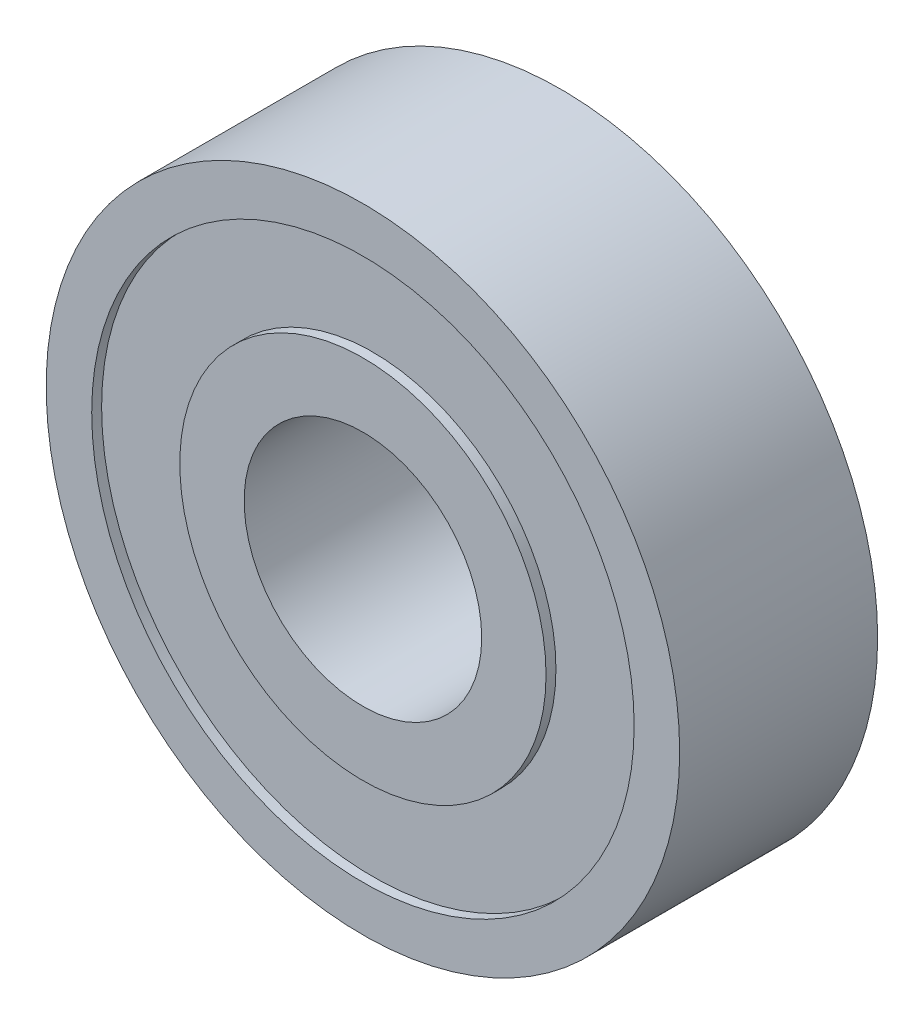
ISO-10303-21;
HEADER;
FILE_DESCRIPTION(('STEP AP214'),'2;1');
FILE_NAME('part.step','',(''),(''),'','','');
FILE_SCHEMA(('AUTOMOTIVE_DESIGN { 1 0 10303 214 1 1 1 1 }'));
ENDSEC;
DATA;
#1=APPLICATION_CONTEXT('core data for automotive mechanical design processes');
#2=APPLICATION_PROTOCOL_DEFINITION('international standard','automotive_design',2000,#1);
#3=PRODUCT_CONTEXT('',#1,'mechanical');
#4=PRODUCT('Part','Part','',(#3));
#5=PRODUCT_RELATED_PRODUCT_CATEGORY('part','',(#4));
#6=PRODUCT_DEFINITION_FORMATION('','',#4);
#7=PRODUCT_DEFINITION_CONTEXT('part definition',#1,'design');
#8=PRODUCT_DEFINITION('design','',#6,#7);
#9=PRODUCT_DEFINITION_SHAPE('','',#8);
#10=(LENGTH_UNIT() NAMED_UNIT(*) SI_UNIT(.MILLI.,.METRE.));
#11=(NAMED_UNIT(*) PLANE_ANGLE_UNIT() SI_UNIT($,.RADIAN.));
#12=(NAMED_UNIT(*) SI_UNIT($,.STERADIAN.) SOLID_ANGLE_UNIT());
#13=UNCERTAINTY_MEASURE_WITH_UNIT(LENGTH_MEASURE(1.E-05),#10,'distance_accuracy_value','');
#14=(GEOMETRIC_REPRESENTATION_CONTEXT(3) GLOBAL_UNCERTAINTY_ASSIGNED_CONTEXT((#13)) GLOBAL_UNIT_ASSIGNED_CONTEXT((#10,
#11,#12)) REPRESENTATION_CONTEXT('',''));
#15=CARTESIAN_POINT('',(0.,0.,0.));
#16=DIRECTION('',(0.,0.,1.));
#17=DIRECTION('',(1.,0.,0.));
#18=AXIS2_PLACEMENT_3D('',#15,#16,#17);
#19=CARTESIAN_POINT('',(0.,0.,-5.));
#20=DIRECTION('',(0.,0.,1.));
#21=DIRECTION('',(1.,0.,0.));
#22=AXIS2_PLACEMENT_3D('',#19,#20,#21);
#23=PLANE('',#22);
#24=CARTESIAN_POINT('',(0.,0.,-5.));
#25=DIRECTION('',(0.,0.,1.));
#26=DIRECTION('',(1.,0.,0.));
#27=AXIS2_PLACEMENT_3D('',#24,#25,#26);
#28=CIRCLE('',#27,6.);
#29=CARTESIAN_POINT('',(6.,0.,-5.));
#30=VERTEX_POINT('',#29);
#31=EDGE_CURVE('E42',#30,#30,#28,.T.);
#32=ORIENTED_EDGE('',*,*,#31,.T.);
#33=EDGE_LOOP('',(#32));
#34=FACE_BOUND('',#33,.T.);
#35=CARTESIAN_POINT('',(0.,0.,-5.));
#36=DIRECTION('',(0.,0.,1.));
#37=DIRECTION('',(1.,0.,0.));
#38=AXIS2_PLACEMENT_3D('',#35,#36,#37);
#39=CIRCLE('',#38,9.25);
#40=CARTESIAN_POINT('',(9.25,0.,-5.));
#41=VERTEX_POINT('',#40);
#42=EDGE_CURVE('E68',#41,#41,#39,.T.);
#43=ORIENTED_EDGE('',*,*,#42,.F.);
#44=EDGE_LOOP('',(#43));
#45=FACE_BOUND('',#44,.T.);
#46=ADVANCED_FACE('F31',(#34,#45),#23,.F.);
#47=CARTESIAN_POINT('',(0.,0.,5.));
#48=DIRECTION('',(0.,0.,1.));
#49=DIRECTION('',(1.,0.,0.));
#50=AXIS2_PLACEMENT_3D('',#47,#48,#49);
#51=PLANE('',#50);
#52=CARTESIAN_POINT('',(0.,0.,5.));
#53=DIRECTION('',(0.,0.,1.));
#54=DIRECTION('',(1.,0.,0.));
#55=AXIS2_PLACEMENT_3D('',#52,#53,#54);
#56=CIRCLE('',#55,6.);
#57=CARTESIAN_POINT('',(6.,0.,5.));
#58=VERTEX_POINT('',#57);
#59=EDGE_CURVE('E44',#58,#58,#56,.T.);
#60=ORIENTED_EDGE('',*,*,#59,.F.);
#61=EDGE_LOOP('',(#60));
#62=FACE_BOUND('',#61,.T.);
#63=CARTESIAN_POINT('',(0.,0.,5.));
#64=DIRECTION('',(0.,0.,1.));
#65=DIRECTION('',(1.,0.,0.));
#66=AXIS2_PLACEMENT_3D('',#63,#64,#65);
#67=CIRCLE('',#66,9.25);
#68=CARTESIAN_POINT('',(9.25,0.,5.));
#69=VERTEX_POINT('',#68);
#70=EDGE_CURVE('E56',#69,#69,#67,.T.);
#71=ORIENTED_EDGE('',*,*,#70,.T.);
#72=EDGE_LOOP('',(#71));
#73=FACE_BOUND('',#72,.T.);
#74=ADVANCED_FACE('F84',(#62,#73),#51,.T.);
#75=CARTESIAN_POINT('',(0.,0.,5.));
#76=DIRECTION('',(0.,0.,-1.));
#77=DIRECTION('',(-1.,0.,0.));
#78=AXIS2_PLACEMENT_3D('',#75,#76,#77);
#79=CYLINDRICAL_SURFACE('',#78,16.);
#80=CARTESIAN_POINT('',(0.,0.,5.));
#81=DIRECTION('',(0.,0.,1.));
#82=DIRECTION('',(1.,0.,0.));
#83=AXIS2_PLACEMENT_3D('',#80,#81,#82);
#84=CIRCLE('',#83,16.);
#85=CARTESIAN_POINT('',(16.,0.,5.));
#86=VERTEX_POINT('',#85);
#87=EDGE_CURVE('E10',#86,#86,#84,.T.);
#88=ORIENTED_EDGE('',*,*,#87,.F.);
#89=EDGE_LOOP('',(#88));
#90=FACE_BOUND('',#89,.T.);
#91=CARTESIAN_POINT('',(0.,0.,-5.));
#92=DIRECTION('',(0.,0.,1.));
#93=DIRECTION('',(1.,0.,0.));
#94=AXIS2_PLACEMENT_3D('',#91,#92,#93);
#95=CIRCLE('',#94,16.);
#96=CARTESIAN_POINT('',(16.,0.,-5.));
#97=VERTEX_POINT('',#96);
#98=EDGE_CURVE('E35',#97,#97,#95,.T.);
#99=ORIENTED_EDGE('',*,*,#98,.T.);
#100=EDGE_LOOP('',(#99));
#101=FACE_BOUND('',#100,.T.);
#102=ADVANCED_FACE('F33',(#90,#101),#79,.T.);
#103=CARTESIAN_POINT('',(0.,0.,5.));
#104=DIRECTION('',(0.,0.,1.));
#105=DIRECTION('',(1.,0.,0.));
#106=AXIS2_PLACEMENT_3D('',#103,#104,#105);
#107=CIRCLE('',#106,13.7);
#108=CARTESIAN_POINT('',(13.7,0.,5.));
#109=VERTEX_POINT('',#108);
#110=EDGE_CURVE('E50',#109,#109,#107,.T.);
#111=ORIENTED_EDGE('',*,*,#110,.F.);
#112=EDGE_LOOP('',(#111));
#113=FACE_BOUND('',#112,.T.);
#114=ORIENTED_EDGE('',*,*,#87,.T.);
#115=EDGE_LOOP('',(#114));
#116=FACE_BOUND('',#115,.T.);
#117=ADVANCED_FACE('F92',(#113,#116),#51,.T.);
#118=CARTESIAN_POINT('',(0.,0.,-5.));
#119=DIRECTION('',(0.,0.,1.));
#120=DIRECTION('',(1.,0.,0.));
#121=AXIS2_PLACEMENT_3D('',#118,#119,#120);
#122=CIRCLE('',#121,13.7);
#123=CARTESIAN_POINT('',(13.7,0.,-5.));
#124=VERTEX_POINT('',#123);
#125=EDGE_CURVE('E62',#124,#124,#122,.T.);
#126=ORIENTED_EDGE('',*,*,#125,.T.);
#127=EDGE_LOOP('',(#126));
#128=FACE_BOUND('',#127,.T.);
#129=ORIENTED_EDGE('',*,*,#98,.F.);
#130=EDGE_LOOP('',(#129));
#131=FACE_BOUND('',#130,.T.);
#132=ADVANCED_FACE('F86',(#128,#131),#23,.F.);
#133=CARTESIAN_POINT('',(0.,0.,-5.));
#134=DIRECTION('',(0.,0.,1.));
#135=DIRECTION('',(1.,0.,0.));
#136=AXIS2_PLACEMENT_3D('',#133,#134,#135);
#137=CYLINDRICAL_SURFACE('',#136,6.);
#138=ORIENTED_EDGE('',*,*,#31,.F.);
#139=EDGE_LOOP('',(#138));
#140=FACE_BOUND('',#139,.T.);
#141=ORIENTED_EDGE('',*,*,#59,.T.);
#142=EDGE_LOOP('',(#141));
#143=FACE_BOUND('',#142,.T.);
#144=ADVANCED_FACE('F94',(#140,#143),#137,.F.);
#145=CARTESIAN_POINT('',(0.,0.,4.5));
#146=DIRECTION('',(0.,0.,1.));
#147=DIRECTION('',(1.,0.,0.));
#148=AXIS2_PLACEMENT_3D('',#145,#146,#147);
#149=CYLINDRICAL_SURFACE('',#148,13.7);
#150=CARTESIAN_POINT('',(0.,0.,4.5));
#151=DIRECTION('',(0.,0.,1.));
#152=DIRECTION('',(1.,0.,0.));
#153=AXIS2_PLACEMENT_3D('',#150,#151,#152);
#154=CIRCLE('',#153,13.7);
#155=CARTESIAN_POINT('',(13.7,0.,4.5));
#156=VERTEX_POINT('',#155);
#157=EDGE_CURVE('E47',#156,#156,#154,.T.);
#158=ORIENTED_EDGE('',*,*,#157,.F.);
#159=EDGE_LOOP('',(#158));
#160=FACE_BOUND('',#159,.T.);
#161=ORIENTED_EDGE('',*,*,#110,.T.);
#162=EDGE_LOOP('',(#161));
#163=FACE_BOUND('',#162,.T.);
#164=ADVANCED_FACE('F100',(#160,#163),#149,.F.);
#165=CARTESIAN_POINT('',(0.,0.,4.5));
#166=DIRECTION('',(0.,0.,1.));
#167=DIRECTION('',(1.,0.,0.));
#168=AXIS2_PLACEMENT_3D('',#165,#166,#167);
#169=PLANE('',#168);
#170=CARTESIAN_POINT('',(0.,0.,4.5));
#171=DIRECTION('',(0.,0.,1.));
#172=DIRECTION('',(1.,0.,0.));
#173=AXIS2_PLACEMENT_3D('',#170,#171,#172);
#174=CIRCLE('',#173,9.25);
#175=CARTESIAN_POINT('',(9.25,0.,4.5));
#176=VERTEX_POINT('',#175);
#177=EDGE_CURVE('E53',#176,#176,#174,.T.);
#178=ORIENTED_EDGE('',*,*,#177,.F.);
#179=EDGE_LOOP('',(#178));
#180=FACE_BOUND('',#179,.T.);
#181=ORIENTED_EDGE('',*,*,#157,.T.);
#182=EDGE_LOOP('',(#181));
#183=FACE_BOUND('',#182,.T.);
#184=ADVANCED_FACE('F131',(#180,#183),#169,.T.);
#185=CARTESIAN_POINT('',(0.,0.,4.5));
#186=DIRECTION('',(0.,0.,1.));
#187=DIRECTION('',(1.,0.,0.));
#188=AXIS2_PLACEMENT_3D('',#185,#186,#187);
#189=CYLINDRICAL_SURFACE('',#188,9.25);
#190=ORIENTED_EDGE('',*,*,#177,.T.);
#191=EDGE_LOOP('',(#190));
#192=FACE_BOUND('',#191,.T.);
#193=ORIENTED_EDGE('',*,*,#70,.F.);
#194=EDGE_LOOP('',(#193));
#195=FACE_BOUND('',#194,.T.);
#196=ADVANCED_FACE('F141',(#192,#195),#189,.T.);
#197=CARTESIAN_POINT('',(0.,0.,-4.5));
#198=DIRECTION('',(0.,0.,-1.));
#199=DIRECTION('',(1.,0.,0.));
#200=AXIS2_PLACEMENT_3D('',#197,#198,#199);
#201=PLANE('',#200);
#202=CARTESIAN_POINT('',(0.,0.,-4.5));
#203=DIRECTION('',(0.,0.,1.));
#204=DIRECTION('',(1.,0.,0.));
#205=AXIS2_PLACEMENT_3D('',#202,#203,#204);
#206=CIRCLE('',#205,13.7);
#207=CARTESIAN_POINT('',(13.7,0.,-4.5));
#208=VERTEX_POINT('',#207);
#209=EDGE_CURVE('E59',#208,#208,#206,.T.);
#210=ORIENTED_EDGE('',*,*,#209,.F.);
#211=EDGE_LOOP('',(#210));
#212=FACE_BOUND('',#211,.T.);
#213=CARTESIAN_POINT('',(0.,0.,-4.5));
#214=DIRECTION('',(0.,0.,1.));
#215=DIRECTION('',(1.,0.,0.));
#216=AXIS2_PLACEMENT_3D('',#213,#214,#215);
#217=CIRCLE('',#216,9.25);
#218=CARTESIAN_POINT('',(9.25,0.,-4.5));
#219=VERTEX_POINT('',#218);
#220=EDGE_CURVE('E65',#219,#219,#217,.T.);
#221=ORIENTED_EDGE('',*,*,#220,.T.);
#222=EDGE_LOOP('',(#221));
#223=FACE_BOUND('',#222,.T.);
#224=ADVANCED_FACE('F74',(#212,#223),#201,.T.);
#225=CARTESIAN_POINT('',(0.,0.,-4.5));
#226=DIRECTION('',(0.,0.,-1.));
#227=DIRECTION('',(-1.,0.,0.));
#228=AXIS2_PLACEMENT_3D('',#225,#226,#227);
#229=CYLINDRICAL_SURFACE('',#228,13.7);
#230=ORIENTED_EDGE('',*,*,#209,.T.);
#231=EDGE_LOOP('',(#230));
#232=FACE_BOUND('',#231,.T.);
#233=ORIENTED_EDGE('',*,*,#125,.F.);
#234=EDGE_LOOP('',(#233));
#235=FACE_BOUND('',#234,.T.);
#236=ADVANCED_FACE('F79',(#232,#235),#229,.F.);
#237=CARTESIAN_POINT('',(0.,0.,-4.5));
#238=DIRECTION('',(0.,0.,-1.));
#239=DIRECTION('',(-1.,0.,0.));
#240=AXIS2_PLACEMENT_3D('',#237,#238,#239);
#241=CYLINDRICAL_SURFACE('',#240,9.25);
#242=ORIENTED_EDGE('',*,*,#220,.F.);
#243=EDGE_LOOP('',(#242));
#244=FACE_BOUND('',#243,.T.);
#245=ORIENTED_EDGE('',*,*,#42,.T.);
#246=EDGE_LOOP('',(#245));
#247=FACE_BOUND('',#246,.T.);
#248=ADVANCED_FACE('F76',(#244,#247),#241,.T.);
#249=CLOSED_SHELL('',(#46,#74,#102,#117,#132,#144,#164,#184,#196,#224,#236,#248));
#250=MANIFOLD_SOLID_BREP('B2',#249);
#251=ADVANCED_BREP_SHAPE_REPRESENTATION('',(#18,#250),#14);
#252=SHAPE_DEFINITION_REPRESENTATION(#9,#251);
ENDSEC;
END-ISO-10303-21;
